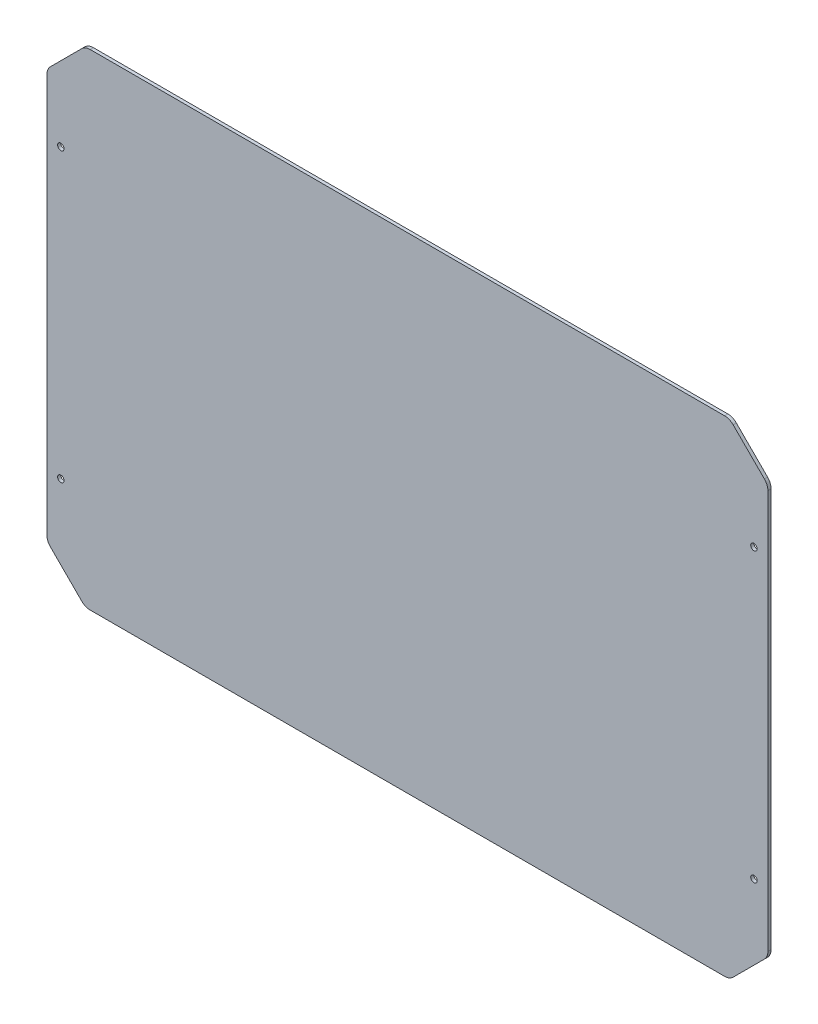
ISO-10303-21;
HEADER;
FILE_DESCRIPTION(('STEP AP214'),'2;1');
FILE_NAME('part.step','',(''),(''),'','','');
FILE_SCHEMA(('AUTOMOTIVE_DESIGN { 1 0 10303 214 1 1 1 1 }'));
ENDSEC;
DATA;
#1=APPLICATION_CONTEXT('core data for automotive mechanical design processes');
#2=APPLICATION_PROTOCOL_DEFINITION('international standard','automotive_design',2000,#1);
#3=PRODUCT_CONTEXT('',#1,'mechanical');
#4=PRODUCT('Part','Part','',(#3));
#5=PRODUCT_RELATED_PRODUCT_CATEGORY('part','',(#4));
#6=PRODUCT_DEFINITION_FORMATION('','',#4);
#7=PRODUCT_DEFINITION_CONTEXT('part definition',#1,'design');
#8=PRODUCT_DEFINITION('design','',#6,#7);
#9=PRODUCT_DEFINITION_SHAPE('','',#8);
#10=(LENGTH_UNIT() NAMED_UNIT(*) SI_UNIT(.MILLI.,.METRE.));
#11=(NAMED_UNIT(*) PLANE_ANGLE_UNIT() SI_UNIT($,.RADIAN.));
#12=(NAMED_UNIT(*) SI_UNIT($,.STERADIAN.) SOLID_ANGLE_UNIT());
#13=UNCERTAINTY_MEASURE_WITH_UNIT(LENGTH_MEASURE(1.E-05),#10,'distance_accuracy_value','');
#14=(GEOMETRIC_REPRESENTATION_CONTEXT(3) GLOBAL_UNCERTAINTY_ASSIGNED_CONTEXT((#13)) GLOBAL_UNIT_ASSIGNED_CONTEXT((#10,
#11,#12)) REPRESENTATION_CONTEXT('',''));
#15=CARTESIAN_POINT('',(0.,0.,0.));
#16=DIRECTION('',(0.,0.,1.));
#17=DIRECTION('',(1.,0.,0.));
#18=AXIS2_PLACEMENT_3D('',#15,#16,#17);
#19=CARTESIAN_POINT('',(0.,0.,4.));
#20=DIRECTION('',(0.,0.,1.));
#21=DIRECTION('',(1.,0.,0.));
#22=AXIS2_PLACEMENT_3D('',#19,#20,#21);
#23=PLANE('',#22);
#24=CARTESIAN_POINT('',(433.999999999995,-180.,4.));
#25=DIRECTION('',(0.,0.,1.));
#26=DIRECTION('',(1.,0.,0.));
#27=AXIS2_PLACEMENT_3D('',#24,#25,#26);
#28=CIRCLE('',#27,4.04999999999967);
#29=CARTESIAN_POINT('',(438.049999999995,-180.,4.));
#30=VERTEX_POINT('',#29);
#31=EDGE_CURVE('E295',#30,#30,#28,.T.);
#32=ORIENTED_EDGE('',*,*,#31,.F.);
#33=EDGE_LOOP('',(#32));
#34=FACE_BOUND('',#33,.T.);
#35=CARTESIAN_POINT('',(-433.999999999995,180.,4.));
#36=DIRECTION('',(0.,0.,1.));
#37=DIRECTION('',(1.,0.,0.));
#38=AXIS2_PLACEMENT_3D('',#35,#36,#37);
#39=CIRCLE('',#38,4.04999999999967);
#40=CARTESIAN_POINT('',(-429.949999999995,180.,4.));
#41=VERTEX_POINT('',#40);
#42=EDGE_CURVE('E174',#41,#41,#39,.T.);
#43=ORIENTED_EDGE('',*,*,#42,.F.);
#44=EDGE_LOOP('',(#43));
#45=FACE_BOUND('',#44,.T.);
#46=DIRECTION('',(0.,-1.,0.));
#47=VECTOR('',#46,1.);
#48=CARTESIAN_POINT('',(-451.499999999995,256.000000000005,4.));
#49=LINE('',#48,#47);
#50=CARTESIAN_POINT('',(-451.499999999995,249.786796564409,4.));
#51=VERTEX_POINT('',#50);
#52=CARTESIAN_POINT('',(-451.499999999995,-249.786796564402,4.));
#53=VERTEX_POINT('',#52);
#54=EDGE_CURVE('E183',#51,#53,#49,.T.);
#55=ORIENTED_EDGE('',*,*,#54,.T.);
#56=CARTESIAN_POINT('',(-436.499999999995,-249.786796564402,4.));
#57=DIRECTION('',(0.,0.,1.));
#58=DIRECTION('',(1.,0.,0.));
#59=AXIS2_PLACEMENT_3D('',#56,#57,#58);
#60=CIRCLE('',#59,15.);
#61=CARTESIAN_POINT('',(-447.106601717793,-260.393398282201,4.));
#62=VERTEX_POINT('',#61);
#63=EDGE_CURVE('E230',#53,#62,#60,.T.);
#64=ORIENTED_EDGE('',*,*,#63,.T.);
#65=DIRECTION('',(0.707106781186548,-0.707106781186547,0.));
#66=VECTOR('',#65,1.);
#67=CARTESIAN_POINT('',(-451.499999999995,-255.999999999999,4.));
#68=LINE('',#67,#66);
#69=CARTESIAN_POINT('',(-407.893398282196,-299.606601717798,4.));
#70=VERTEX_POINT('',#69);
#71=EDGE_CURVE('E166',#62,#70,#68,.T.);
#72=ORIENTED_EDGE('',*,*,#71,.T.);
#73=CARTESIAN_POINT('',(-397.286796564398,-289.,4.));
#74=DIRECTION('',(0.,0.,1.));
#75=DIRECTION('',(1.,0.,0.));
#76=AXIS2_PLACEMENT_3D('',#73,#74,#75);
#77=CIRCLE('',#76,15.);
#78=CARTESIAN_POINT('',(-397.286796564398,-304.,4.));
#79=VERTEX_POINT('',#78);
#80=EDGE_CURVE('E228',#70,#79,#77,.T.);
#81=ORIENTED_EDGE('',*,*,#80,.T.);
#82=DIRECTION('',(1.,0.,0.));
#83=VECTOR('',#82,1.);
#84=CARTESIAN_POINT('',(-403.499999999994,-304.,4.));
#85=LINE('',#84,#83);
#86=CARTESIAN_POINT('',(397.286796564398,-304.,4.));
#87=VERTEX_POINT('',#86);
#88=EDGE_CURVE('E285',#79,#87,#85,.T.);
#89=ORIENTED_EDGE('',*,*,#88,.T.);
#90=CARTESIAN_POINT('',(397.286796564398,-289.,4.));
#91=DIRECTION('',(0.,0.,1.));
#92=DIRECTION('',(1.,0.,0.));
#93=AXIS2_PLACEMENT_3D('',#90,#91,#92);
#94=CIRCLE('',#93,15.);
#95=CARTESIAN_POINT('',(407.893398282197,-299.606601717798,4.));
#96=VERTEX_POINT('',#95);
#97=EDGE_CURVE('E226',#87,#96,#94,.T.);
#98=ORIENTED_EDGE('',*,*,#97,.T.);
#99=DIRECTION('',(0.707106781186547,0.707106781186548,0.));
#100=VECTOR('',#99,1.);
#101=CARTESIAN_POINT('',(403.499999999995,-304.,4.));
#102=LINE('',#101,#100);
#103=CARTESIAN_POINT('',(447.106601717803,-260.393398282191,4.));
#104=VERTEX_POINT('',#103);
#105=EDGE_CURVE('E282',#96,#104,#102,.T.);
#106=ORIENTED_EDGE('',*,*,#105,.T.);
#107=CARTESIAN_POINT('',(436.500000000005,-249.786796564393,4.));
#108=DIRECTION('',(0.,0.,1.));
#109=DIRECTION('',(1.,0.,0.));
#110=AXIS2_PLACEMENT_3D('',#107,#108,#109);
#111=CIRCLE('',#110,15.);
#112=CARTESIAN_POINT('',(451.500000000005,-249.786796564393,4.));
#113=VERTEX_POINT('',#112);
#114=EDGE_CURVE('E224',#104,#113,#111,.T.);
#115=ORIENTED_EDGE('',*,*,#114,.T.);
#116=DIRECTION('',(0.,1.,0.));
#117=VECTOR('',#116,1.);
#118=CARTESIAN_POINT('',(451.500000000005,255.999999999995,4.));
#119=LINE('',#118,#117);
#120=CARTESIAN_POINT('',(451.500000000005,249.786796564399,4.));
#121=VERTEX_POINT('',#120);
#122=EDGE_CURVE('E279',#113,#121,#119,.T.);
#123=ORIENTED_EDGE('',*,*,#122,.T.);
#124=CARTESIAN_POINT('',(436.500000000005,249.786796564399,4.));
#125=DIRECTION('',(0.,0.,1.));
#126=DIRECTION('',(1.,0.,0.));
#127=AXIS2_PLACEMENT_3D('',#124,#125,#126);
#128=CIRCLE('',#127,15.);
#129=CARTESIAN_POINT('',(447.106601717803,260.393398282197,4.));
#130=VERTEX_POINT('',#129);
#131=EDGE_CURVE('E222',#121,#130,#128,.T.);
#132=ORIENTED_EDGE('',*,*,#131,.T.);
#133=DIRECTION('',(-0.707106781186548,0.707106781186548,0.));
#134=VECTOR('',#133,1.);
#135=CARTESIAN_POINT('',(403.5,304.,4.));
#136=LINE('',#135,#134);
#137=CARTESIAN_POINT('',(407.893398282202,299.606601717798,4.));
#138=VERTEX_POINT('',#137);
#139=EDGE_CURVE('E274',#130,#138,#136,.T.);
#140=ORIENTED_EDGE('',*,*,#139,.T.);
#141=CARTESIAN_POINT('',(397.286796564404,289.,4.));
#142=DIRECTION('',(0.,0.,1.));
#143=DIRECTION('',(1.,0.,0.));
#144=AXIS2_PLACEMENT_3D('',#141,#142,#143);
#145=CIRCLE('',#144,15.);
#146=CARTESIAN_POINT('',(397.286796564404,304.,4.));
#147=VERTEX_POINT('',#146);
#148=EDGE_CURVE('E220',#138,#147,#145,.T.);
#149=ORIENTED_EDGE('',*,*,#148,.T.);
#150=DIRECTION('',(-1.,0.,0.));
#151=VECTOR('',#150,1.);
#152=CARTESIAN_POINT('',(-403.500000000001,304.,4.));
#153=LINE('',#152,#151);
#154=CARTESIAN_POINT('',(-397.286796564404,304.,4.));
#155=VERTEX_POINT('',#154);
#156=EDGE_CURVE('E262',#147,#155,#153,.T.);
#157=ORIENTED_EDGE('',*,*,#156,.T.);
#158=CARTESIAN_POINT('',(-397.286796564404,289.,4.));
#159=DIRECTION('',(0.,0.,1.));
#160=DIRECTION('',(1.,0.,0.));
#161=AXIS2_PLACEMENT_3D('',#158,#159,#160);
#162=CIRCLE('',#161,15.);
#163=CARTESIAN_POINT('',(-407.893398282202,299.606601717798,4.));
#164=VERTEX_POINT('',#163);
#165=EDGE_CURVE('E53',#155,#164,#162,.T.);
#166=ORIENTED_EDGE('',*,*,#165,.T.);
#167=DIRECTION('',(-0.707106781186548,-0.707106781186547,0.));
#168=VECTOR('',#167,1.);
#169=CARTESIAN_POINT('',(-403.500000000001,304.,4.));
#170=LINE('',#169,#168);
#171=CARTESIAN_POINT('',(-447.106601717793,260.393398282207,4.));
#172=VERTEX_POINT('',#171);
#173=EDGE_CURVE('E271',#164,#172,#170,.T.);
#174=ORIENTED_EDGE('',*,*,#173,.T.);
#175=CARTESIAN_POINT('',(-436.499999999995,249.786796564409,4.));
#176=DIRECTION('',(0.,0.,1.));
#177=DIRECTION('',(1.,0.,0.));
#178=AXIS2_PLACEMENT_3D('',#175,#176,#177);
#179=CIRCLE('',#178,15.);
#180=EDGE_CURVE('E217',#172,#51,#179,.T.);
#181=ORIENTED_EDGE('',*,*,#180,.T.);
#182=EDGE_LOOP('',(#55,#64,#72,#81,#89,#98,#106,#115,#123,#132,#140,#149,#157,#166,#174,#181));
#183=FACE_BOUND('',#182,.T.);
#184=CARTESIAN_POINT('',(-433.999999999995,-180.,4.));
#185=DIRECTION('',(0.,0.,1.));
#186=DIRECTION('',(1.,0.,0.));
#187=AXIS2_PLACEMENT_3D('',#184,#185,#186);
#188=CIRCLE('',#187,4.04999999999967);
#189=CARTESIAN_POINT('',(-429.949999999995,-180.,4.));
#190=VERTEX_POINT('',#189);
#191=EDGE_CURVE('E290',#190,#190,#188,.T.);
#192=ORIENTED_EDGE('',*,*,#191,.F.);
#193=EDGE_LOOP('',(#192));
#194=FACE_BOUND('',#193,.T.);
#195=CARTESIAN_POINT('',(433.999999999995,180.,4.));
#196=DIRECTION('',(0.,0.,1.));
#197=DIRECTION('',(1.,0.,0.));
#198=AXIS2_PLACEMENT_3D('',#195,#196,#197);
#199=CIRCLE('',#198,4.04999999999967);
#200=CARTESIAN_POINT('',(438.049999999995,180.,4.));
#201=VERTEX_POINT('',#200);
#202=EDGE_CURVE('E301',#201,#201,#199,.T.);
#203=ORIENTED_EDGE('',*,*,#202,.F.);
#204=EDGE_LOOP('',(#203));
#205=FACE_BOUND('',#204,.T.);
#206=ADVANCED_FACE('F32',(#34,#45,#183,#194,#205),#23,.T.);
#207=CARTESIAN_POINT('',(0.,0.,0.));
#208=DIRECTION('',(0.,0.,1.));
#209=DIRECTION('',(1.,0.,0.));
#210=AXIS2_PLACEMENT_3D('',#207,#208,#209);
#211=PLANE('',#210);
#212=DIRECTION('',(0.707106781186548,-0.707106781186547,0.));
#213=VECTOR('',#212,1.);
#214=CARTESIAN_POINT('',(-451.499999999995,-255.999999999999,0.));
#215=LINE('',#214,#213);
#216=CARTESIAN_POINT('',(-447.106601717793,-260.393398282201,0.));
#217=VERTEX_POINT('',#216);
#218=CARTESIAN_POINT('',(-407.893398282196,-299.606601717798,0.));
#219=VERTEX_POINT('',#218);
#220=EDGE_CURVE('E163',#217,#219,#215,.T.);
#221=ORIENTED_EDGE('',*,*,#220,.F.);
#222=CARTESIAN_POINT('',(-436.499999999995,-249.786796564402,0.));
#223=DIRECTION('',(0.,0.,1.));
#224=DIRECTION('',(1.,0.,0.));
#225=AXIS2_PLACEMENT_3D('',#222,#223,#224);
#226=CIRCLE('',#225,15.);
#227=CARTESIAN_POINT('',(-451.499999999995,-249.786796564402,0.));
#228=VERTEX_POINT('',#227);
#229=EDGE_CURVE('E146',#217,#228,#226,.F.);
#230=ORIENTED_EDGE('',*,*,#229,.T.);
#231=DIRECTION('',(0.,-1.,0.));
#232=VECTOR('',#231,1.);
#233=CARTESIAN_POINT('',(-451.499999999995,256.000000000005,0.));
#234=LINE('',#233,#232);
#235=CARTESIAN_POINT('',(-451.499999999995,249.786796564409,0.));
#236=VERTEX_POINT('',#235);
#237=EDGE_CURVE('E199',#236,#228,#234,.T.);
#238=ORIENTED_EDGE('',*,*,#237,.F.);
#239=CARTESIAN_POINT('',(-436.499999999995,249.786796564409,0.));
#240=DIRECTION('',(0.,0.,1.));
#241=DIRECTION('',(1.,0.,0.));
#242=AXIS2_PLACEMENT_3D('',#239,#240,#241);
#243=CIRCLE('',#242,15.);
#244=CARTESIAN_POINT('',(-447.106601717793,260.393398282207,0.));
#245=VERTEX_POINT('',#244);
#246=EDGE_CURVE('E167',#236,#245,#243,.F.);
#247=ORIENTED_EDGE('',*,*,#246,.T.);
#248=DIRECTION('',(-0.707106781186548,-0.707106781186547,0.));
#249=VECTOR('',#248,1.);
#250=CARTESIAN_POINT('',(-403.500000000001,304.,0.));
#251=LINE('',#250,#249);
#252=CARTESIAN_POINT('',(-407.893398282202,299.606601717798,0.));
#253=VERTEX_POINT('',#252);
#254=EDGE_CURVE('E197',#253,#245,#251,.T.);
#255=ORIENTED_EDGE('',*,*,#254,.F.);
#256=CARTESIAN_POINT('',(-397.286796564404,289.,0.));
#257=DIRECTION('',(0.,0.,1.));
#258=DIRECTION('',(1.,0.,0.));
#259=AXIS2_PLACEMENT_3D('',#256,#257,#258);
#260=CIRCLE('',#259,15.);
#261=CARTESIAN_POINT('',(-397.286796564404,304.,0.));
#262=VERTEX_POINT('',#261);
#263=EDGE_CURVE('E203',#253,#262,#260,.F.);
#264=ORIENTED_EDGE('',*,*,#263,.T.);
#265=DIRECTION('',(-1.,0.,0.));
#266=VECTOR('',#265,1.);
#267=CARTESIAN_POINT('',(-403.500000000001,304.,0.));
#268=LINE('',#267,#266);
#269=CARTESIAN_POINT('',(397.286796564404,304.,0.));
#270=VERTEX_POINT('',#269);
#271=EDGE_CURVE('E194',#270,#262,#268,.T.);
#272=ORIENTED_EDGE('',*,*,#271,.F.);
#273=CARTESIAN_POINT('',(397.286796564404,289.,0.));
#274=DIRECTION('',(0.,0.,1.));
#275=DIRECTION('',(1.,0.,0.));
#276=AXIS2_PLACEMENT_3D('',#273,#274,#275);
#277=CIRCLE('',#276,15.);
#278=CARTESIAN_POINT('',(407.893398282202,299.606601717798,0.));
#279=VERTEX_POINT('',#278);
#280=EDGE_CURVE('E205',#270,#279,#277,.F.);
#281=ORIENTED_EDGE('',*,*,#280,.T.);
#282=DIRECTION('',(-0.707106781186548,0.707106781186548,0.));
#283=VECTOR('',#282,1.);
#284=CARTESIAN_POINT('',(403.5,304.,0.));
#285=LINE('',#284,#283);
#286=CARTESIAN_POINT('',(447.106601717803,260.393398282197,0.));
#287=VERTEX_POINT('',#286);
#288=EDGE_CURVE('E191',#287,#279,#285,.T.);
#289=ORIENTED_EDGE('',*,*,#288,.F.);
#290=CARTESIAN_POINT('',(436.500000000005,249.786796564399,0.));
#291=DIRECTION('',(0.,0.,1.));
#292=DIRECTION('',(1.,0.,0.));
#293=AXIS2_PLACEMENT_3D('',#290,#291,#292);
#294=CIRCLE('',#293,15.);
#295=CARTESIAN_POINT('',(451.500000000005,249.786796564399,0.));
#296=VERTEX_POINT('',#295);
#297=EDGE_CURVE('E207',#287,#296,#294,.F.);
#298=ORIENTED_EDGE('',*,*,#297,.T.);
#299=DIRECTION('',(0.,1.,0.));
#300=VECTOR('',#299,1.);
#301=CARTESIAN_POINT('',(451.500000000005,255.999999999995,0.));
#302=LINE('',#301,#300);
#303=CARTESIAN_POINT('',(451.500000000005,-249.786796564393,0.));
#304=VERTEX_POINT('',#303);
#305=EDGE_CURVE('E188',#304,#296,#302,.T.);
#306=ORIENTED_EDGE('',*,*,#305,.F.);
#307=CARTESIAN_POINT('',(436.500000000005,-249.786796564393,0.));
#308=DIRECTION('',(0.,0.,1.));
#309=DIRECTION('',(1.,0.,0.));
#310=AXIS2_PLACEMENT_3D('',#307,#308,#309);
#311=CIRCLE('',#310,15.);
#312=CARTESIAN_POINT('',(447.106601717803,-260.393398282191,0.));
#313=VERTEX_POINT('',#312);
#314=EDGE_CURVE('E209',#304,#313,#311,.F.);
#315=ORIENTED_EDGE('',*,*,#314,.T.);
#316=DIRECTION('',(0.707106781186547,0.707106781186548,0.));
#317=VECTOR('',#316,1.);
#318=CARTESIAN_POINT('',(403.499999999995,-304.,0.));
#319=LINE('',#318,#317);
#320=CARTESIAN_POINT('',(407.893398282197,-299.606601717798,0.));
#321=VERTEX_POINT('',#320);
#322=EDGE_CURVE('E177',#321,#313,#319,.T.);
#323=ORIENTED_EDGE('',*,*,#322,.F.);
#324=CARTESIAN_POINT('',(397.286796564398,-289.,0.));
#325=DIRECTION('',(0.,0.,1.));
#326=DIRECTION('',(1.,0.,0.));
#327=AXIS2_PLACEMENT_3D('',#324,#325,#326);
#328=CIRCLE('',#327,15.);
#329=CARTESIAN_POINT('',(397.286796564398,-304.,0.));
#330=VERTEX_POINT('',#329);
#331=EDGE_CURVE('E211',#321,#330,#328,.F.);
#332=ORIENTED_EDGE('',*,*,#331,.T.);
#333=DIRECTION('',(1.,0.,0.));
#334=VECTOR('',#333,1.);
#335=CARTESIAN_POINT('',(-403.499999999994,-304.,0.));
#336=LINE('',#335,#334);
#337=CARTESIAN_POINT('',(-397.286796564398,-304.,0.));
#338=VERTEX_POINT('',#337);
#339=EDGE_CURVE('E173',#338,#330,#336,.T.);
#340=ORIENTED_EDGE('',*,*,#339,.F.);
#341=CARTESIAN_POINT('',(-397.286796564398,-289.,0.));
#342=DIRECTION('',(0.,0.,1.));
#343=DIRECTION('',(1.,0.,0.));
#344=AXIS2_PLACEMENT_3D('',#341,#342,#343);
#345=CIRCLE('',#344,15.);
#346=EDGE_CURVE('E157',#338,#219,#345,.F.);
#347=ORIENTED_EDGE('',*,*,#346,.T.);
#348=EDGE_LOOP('',(#221,#230,#238,#247,#255,#264,#272,#281,#289,#298,#306,#315,#323,#332,#340,#347));
#349=FACE_BOUND('',#348,.T.);
#350=CARTESIAN_POINT('',(-433.999999999995,180.,0.));
#351=DIRECTION('',(0.,0.,1.));
#352=DIRECTION('',(1.,0.,0.));
#353=AXIS2_PLACEMENT_3D('',#350,#351,#352);
#354=CIRCLE('',#353,4.04999999999967);
#355=CARTESIAN_POINT('',(-429.949999999995,180.,0.));
#356=VERTEX_POINT('',#355);
#357=EDGE_CURVE('E180',#356,#356,#354,.T.);
#358=ORIENTED_EDGE('',*,*,#357,.T.);
#359=EDGE_LOOP('',(#358));
#360=FACE_BOUND('',#359,.T.);
#361=CARTESIAN_POINT('',(-433.999999999995,-180.,0.));
#362=DIRECTION('',(0.,0.,1.));
#363=DIRECTION('',(1.,0.,0.));
#364=AXIS2_PLACEMENT_3D('',#361,#362,#363);
#365=CIRCLE('',#364,4.04999999999967);
#366=CARTESIAN_POINT('',(-429.949999999995,-180.,0.));
#367=VERTEX_POINT('',#366);
#368=EDGE_CURVE('E292',#367,#367,#365,.T.);
#369=ORIENTED_EDGE('',*,*,#368,.T.);
#370=EDGE_LOOP('',(#369));
#371=FACE_BOUND('',#370,.T.);
#372=CARTESIAN_POINT('',(433.999999999995,-180.,0.));
#373=DIRECTION('',(0.,0.,1.));
#374=DIRECTION('',(1.,0.,0.));
#375=AXIS2_PLACEMENT_3D('',#372,#373,#374);
#376=CIRCLE('',#375,4.04999999999967);
#377=CARTESIAN_POINT('',(438.049999999995,-180.,0.));
#378=VERTEX_POINT('',#377);
#379=EDGE_CURVE('E298',#378,#378,#376,.T.);
#380=ORIENTED_EDGE('',*,*,#379,.T.);
#381=EDGE_LOOP('',(#380));
#382=FACE_BOUND('',#381,.T.);
#383=CARTESIAN_POINT('',(433.999999999995,180.,0.));
#384=DIRECTION('',(0.,0.,1.));
#385=DIRECTION('',(1.,0.,0.));
#386=AXIS2_PLACEMENT_3D('',#383,#384,#385);
#387=CIRCLE('',#386,4.04999999999967);
#388=CARTESIAN_POINT('',(438.049999999995,180.,0.));
#389=VERTEX_POINT('',#388);
#390=EDGE_CURVE('E304',#389,#389,#387,.T.);
#391=ORIENTED_EDGE('',*,*,#390,.T.);
#392=EDGE_LOOP('',(#391));
#393=FACE_BOUND('',#392,.T.);
#394=ADVANCED_FACE('F170',(#349,#360,#371,#382,#393),#211,.F.);
#395=CARTESIAN_POINT('',(-451.499999999995,-255.999999999999,4.));
#396=DIRECTION('',(0.707106781186547,0.707106781186548,0.));
#397=DIRECTION('',(-0.707106781186548,0.707106781186547,0.));
#398=AXIS2_PLACEMENT_3D('',#395,#396,#397);
#399=PLANE('',#398);
#400=ORIENTED_EDGE('',*,*,#71,.F.);
#401=DIRECTION('',(0.,0.,-1.));
#402=VECTOR('',#401,1.);
#403=CARTESIAN_POINT('',(-447.106601717793,-260.393398282201,4.));
#404=LINE('',#403,#402);
#405=EDGE_CURVE('E150',#62,#217,#404,.T.);
#406=ORIENTED_EDGE('',*,*,#405,.T.);
#407=ORIENTED_EDGE('',*,*,#220,.T.);
#408=DIRECTION('',(0.,0.,-1.));
#409=VECTOR('',#408,1.);
#410=CARTESIAN_POINT('',(-407.893398282196,-299.606601717798,4.));
#411=LINE('',#410,#409);
#412=EDGE_CURVE('E168',#219,#70,#411,.F.);
#413=ORIENTED_EDGE('',*,*,#412,.T.);
#414=EDGE_LOOP('',(#400,#406,#407,#413));
#415=FACE_BOUND('',#414,.T.);
#416=ADVANCED_FACE('F162',(#415),#399,.F.);
#417=CARTESIAN_POINT('',(-403.499999999994,-304.,4.));
#418=DIRECTION('',(0.,1.,0.));
#419=DIRECTION('',(-1.,0.,0.));
#420=AXIS2_PLACEMENT_3D('',#417,#418,#419);
#421=PLANE('',#420);
#422=ORIENTED_EDGE('',*,*,#88,.F.);
#423=DIRECTION('',(0.,0.,-1.));
#424=VECTOR('',#423,1.);
#425=CARTESIAN_POINT('',(-397.286796564398,-304.,4.));
#426=LINE('',#425,#424);
#427=EDGE_CURVE('E234',#79,#338,#426,.T.);
#428=ORIENTED_EDGE('',*,*,#427,.T.);
#429=ORIENTED_EDGE('',*,*,#339,.T.);
#430=DIRECTION('',(0.,0.,-1.));
#431=VECTOR('',#430,1.);
#432=CARTESIAN_POINT('',(397.286796564398,-304.,4.));
#433=LINE('',#432,#431);
#434=EDGE_CURVE('E232',#330,#87,#433,.F.);
#435=ORIENTED_EDGE('',*,*,#434,.T.);
#436=EDGE_LOOP('',(#422,#428,#429,#435));
#437=FACE_BOUND('',#436,.T.);
#438=ADVANCED_FACE('F345',(#437),#421,.F.);
#439=CARTESIAN_POINT('',(403.499999999995,-304.,4.));
#440=DIRECTION('',(-0.707106781186548,0.707106781186547,0.));
#441=DIRECTION('',(-0.707106781186547,-0.707106781186548,0.));
#442=AXIS2_PLACEMENT_3D('',#439,#440,#441);
#443=PLANE('',#442);
#444=ORIENTED_EDGE('',*,*,#105,.F.);
#445=DIRECTION('',(0.,0.,-1.));
#446=VECTOR('',#445,1.);
#447=CARTESIAN_POINT('',(407.893398282197,-299.606601717798,4.));
#448=LINE('',#447,#446);
#449=EDGE_CURVE('E239',#96,#321,#448,.T.);
#450=ORIENTED_EDGE('',*,*,#449,.T.);
#451=ORIENTED_EDGE('',*,*,#322,.T.);
#452=DIRECTION('',(0.,0.,-1.));
#453=VECTOR('',#452,1.);
#454=CARTESIAN_POINT('',(447.106601717803,-260.393398282191,4.));
#455=LINE('',#454,#453);
#456=EDGE_CURVE('E237',#313,#104,#455,.F.);
#457=ORIENTED_EDGE('',*,*,#456,.T.);
#458=EDGE_LOOP('',(#444,#450,#451,#457));
#459=FACE_BOUND('',#458,.T.);
#460=ADVANCED_FACE('F341',(#459),#443,.F.);
#461=CARTESIAN_POINT('',(451.500000000005,255.999999999995,4.));
#462=DIRECTION('',(-1.,0.,0.));
#463=DIRECTION('',(0.,0.,1.));
#464=AXIS2_PLACEMENT_3D('',#461,#462,#463);
#465=PLANE('',#464);
#466=ORIENTED_EDGE('',*,*,#122,.F.);
#467=DIRECTION('',(0.,0.,-1.));
#468=VECTOR('',#467,1.);
#469=CARTESIAN_POINT('',(451.500000000005,-249.786796564393,4.));
#470=LINE('',#469,#468);
#471=EDGE_CURVE('E244',#113,#304,#470,.T.);
#472=ORIENTED_EDGE('',*,*,#471,.T.);
#473=ORIENTED_EDGE('',*,*,#305,.T.);
#474=DIRECTION('',(0.,0.,-1.));
#475=VECTOR('',#474,1.);
#476=CARTESIAN_POINT('',(451.500000000005,249.786796564399,4.));
#477=LINE('',#476,#475);
#478=EDGE_CURVE('E242',#296,#121,#477,.F.);
#479=ORIENTED_EDGE('',*,*,#478,.T.);
#480=EDGE_LOOP('',(#466,#472,#473,#479));
#481=FACE_BOUND('',#480,.T.);
#482=ADVANCED_FACE('F337',(#481),#465,.F.);
#483=CARTESIAN_POINT('',(403.5,304.,4.));
#484=DIRECTION('',(-0.707106781186547,-0.707106781186547,0.));
#485=DIRECTION('',(0.707106781186548,-0.707106781186548,0.));
#486=AXIS2_PLACEMENT_3D('',#483,#484,#485);
#487=PLANE('',#486);
#488=ORIENTED_EDGE('',*,*,#139,.F.);
#489=DIRECTION('',(0.,0.,-1.));
#490=VECTOR('',#489,1.);
#491=CARTESIAN_POINT('',(447.106601717803,260.393398282197,4.));
#492=LINE('',#491,#490);
#493=EDGE_CURVE('E249',#130,#287,#492,.T.);
#494=ORIENTED_EDGE('',*,*,#493,.T.);
#495=ORIENTED_EDGE('',*,*,#288,.T.);
#496=DIRECTION('',(0.,0.,-1.));
#497=VECTOR('',#496,1.);
#498=CARTESIAN_POINT('',(407.893398282202,299.606601717798,4.));
#499=LINE('',#498,#497);
#500=EDGE_CURVE('E247',#279,#138,#499,.F.);
#501=ORIENTED_EDGE('',*,*,#500,.T.);
#502=EDGE_LOOP('',(#488,#494,#495,#501));
#503=FACE_BOUND('',#502,.T.);
#504=ADVANCED_FACE('F334',(#503),#487,.F.);
#505=CARTESIAN_POINT('',(-403.500000000001,304.,4.));
#506=DIRECTION('',(0.,-1.,0.));
#507=DIRECTION('',(1.,0.,0.));
#508=AXIS2_PLACEMENT_3D('',#505,#506,#507);
#509=PLANE('',#508);
#510=ORIENTED_EDGE('',*,*,#156,.F.);
#511=DIRECTION('',(0.,0.,-1.));
#512=VECTOR('',#511,1.);
#513=CARTESIAN_POINT('',(397.286796564404,304.,4.));
#514=LINE('',#513,#512);
#515=EDGE_CURVE('E254',#147,#270,#514,.T.);
#516=ORIENTED_EDGE('',*,*,#515,.T.);
#517=ORIENTED_EDGE('',*,*,#271,.T.);
#518=DIRECTION('',(0.,0.,-1.));
#519=VECTOR('',#518,1.);
#520=CARTESIAN_POINT('',(-397.286796564404,304.,4.));
#521=LINE('',#520,#519);
#522=EDGE_CURVE('E252',#262,#155,#521,.F.);
#523=ORIENTED_EDGE('',*,*,#522,.T.);
#524=EDGE_LOOP('',(#510,#516,#517,#523));
#525=FACE_BOUND('',#524,.T.);
#526=ADVANCED_FACE('F260',(#525),#509,.F.);
#527=CARTESIAN_POINT('',(-403.500000000001,304.,4.));
#528=DIRECTION('',(0.707106781186547,-0.707106781186548,0.));
#529=DIRECTION('',(0.707106781186548,0.707106781186547,0.));
#530=AXIS2_PLACEMENT_3D('',#527,#528,#529);
#531=PLANE('',#530);
#532=ORIENTED_EDGE('',*,*,#173,.F.);
#533=DIRECTION('',(0.,0.,-1.));
#534=VECTOR('',#533,1.);
#535=CARTESIAN_POINT('',(-407.893398282202,299.606601717798,4.));
#536=LINE('',#535,#534);
#537=EDGE_CURVE('E11',#164,#253,#536,.T.);
#538=ORIENTED_EDGE('',*,*,#537,.T.);
#539=ORIENTED_EDGE('',*,*,#254,.T.);
#540=DIRECTION('',(0.,0.,-1.));
#541=VECTOR('',#540,1.);
#542=CARTESIAN_POINT('',(-447.106601717793,260.393398282207,4.));
#543=LINE('',#542,#541);
#544=EDGE_CURVE('E40',#245,#172,#543,.F.);
#545=ORIENTED_EDGE('',*,*,#544,.T.);
#546=EDGE_LOOP('',(#532,#538,#539,#545));
#547=FACE_BOUND('',#546,.T.);
#548=ADVANCED_FACE('F270',(#547),#531,.F.);
#549=CARTESIAN_POINT('',(-451.499999999995,256.000000000005,4.));
#550=DIRECTION('',(1.,0.,0.));
#551=DIRECTION('',(0.,0.,-1.));
#552=AXIS2_PLACEMENT_3D('',#549,#550,#551);
#553=PLANE('',#552);
#554=ORIENTED_EDGE('',*,*,#237,.T.);
#555=DIRECTION('',(0.,0.,-1.));
#556=VECTOR('',#555,1.);
#557=CARTESIAN_POINT('',(-451.499999999995,-249.786796564402,4.));
#558=LINE('',#557,#556);
#559=EDGE_CURVE('E151',#228,#53,#558,.F.);
#560=ORIENTED_EDGE('',*,*,#559,.T.);
#561=ORIENTED_EDGE('',*,*,#54,.F.);
#562=DIRECTION('',(0.,0.,-1.));
#563=VECTOR('',#562,1.);
#564=CARTESIAN_POINT('',(-451.499999999995,249.786796564409,4.));
#565=LINE('',#564,#563);
#566=EDGE_CURVE('E156',#51,#236,#565,.T.);
#567=ORIENTED_EDGE('',*,*,#566,.T.);
#568=EDGE_LOOP('',(#554,#560,#561,#567));
#569=FACE_BOUND('',#568,.T.);
#570=ADVANCED_FACE('F326',(#569),#553,.F.);
#571=CARTESIAN_POINT('',(-433.999999999995,180.,4.));
#572=DIRECTION('',(0.,0.,-1.));
#573=DIRECTION('',(-1.,0.,0.));
#574=AXIS2_PLACEMENT_3D('',#571,#572,#573);
#575=CYLINDRICAL_SURFACE('',#574,4.04999999999967);
#576=ORIENTED_EDGE('',*,*,#42,.T.);
#577=EDGE_LOOP('',(#576));
#578=FACE_BOUND('',#577,.T.);
#579=ORIENTED_EDGE('',*,*,#357,.F.);
#580=EDGE_LOOP('',(#579));
#581=FACE_BOUND('',#580,.T.);
#582=ADVANCED_FACE('F323',(#578,#581),#575,.F.);
#583=CARTESIAN_POINT('',(-433.999999999995,-180.,4.));
#584=DIRECTION('',(0.,0.,-1.));
#585=DIRECTION('',(-1.,0.,0.));
#586=AXIS2_PLACEMENT_3D('',#583,#584,#585);
#587=CYLINDRICAL_SURFACE('',#586,4.04999999999967);
#588=ORIENTED_EDGE('',*,*,#191,.T.);
#589=EDGE_LOOP('',(#588));
#590=FACE_BOUND('',#589,.T.);
#591=ORIENTED_EDGE('',*,*,#368,.F.);
#592=EDGE_LOOP('',(#591));
#593=FACE_BOUND('',#592,.T.);
#594=ADVANCED_FACE('F402',(#590,#593),#587,.F.);
#595=CARTESIAN_POINT('',(433.999999999995,-180.,4.));
#596=DIRECTION('',(0.,0.,-1.));
#597=DIRECTION('',(-1.,0.,0.));
#598=AXIS2_PLACEMENT_3D('',#595,#596,#597);
#599=CYLINDRICAL_SURFACE('',#598,4.04999999999967);
#600=ORIENTED_EDGE('',*,*,#31,.T.);
#601=EDGE_LOOP('',(#600));
#602=FACE_BOUND('',#601,.T.);
#603=ORIENTED_EDGE('',*,*,#379,.F.);
#604=EDGE_LOOP('',(#603));
#605=FACE_BOUND('',#604,.T.);
#606=ADVANCED_FACE('F405',(#602,#605),#599,.F.);
#607=CARTESIAN_POINT('',(433.999999999995,180.,4.));
#608=DIRECTION('',(0.,0.,-1.));
#609=DIRECTION('',(-1.,0.,0.));
#610=AXIS2_PLACEMENT_3D('',#607,#608,#609);
#611=CYLINDRICAL_SURFACE('',#610,4.04999999999967);
#612=ORIENTED_EDGE('',*,*,#202,.T.);
#613=EDGE_LOOP('',(#612));
#614=FACE_BOUND('',#613,.T.);
#615=ORIENTED_EDGE('',*,*,#390,.F.);
#616=EDGE_LOOP('',(#615));
#617=FACE_BOUND('',#616,.T.);
#618=ADVANCED_FACE('F310',(#614,#617),#611,.F.);
#619=CARTESIAN_POINT('',(-436.499999999995,-249.786796564402,4.));
#620=DIRECTION('',(0.,0.,-1.));
#621=DIRECTION('',(-1.,0.,0.));
#622=AXIS2_PLACEMENT_3D('',#619,#620,#621);
#623=CYLINDRICAL_SURFACE('',#622,15.);
#624=ORIENTED_EDGE('',*,*,#63,.F.);
#625=ORIENTED_EDGE('',*,*,#559,.F.);
#626=ORIENTED_EDGE('',*,*,#229,.F.);
#627=ORIENTED_EDGE('',*,*,#405,.F.);
#628=EDGE_LOOP('',(#624,#625,#626,#627));
#629=FACE_BOUND('',#628,.T.);
#630=ADVANCED_FACE('F149',(#629),#623,.T.);
#631=CARTESIAN_POINT('',(-397.286796564398,-289.,4.));
#632=DIRECTION('',(0.,0.,-1.));
#633=DIRECTION('',(-1.,0.,0.));
#634=AXIS2_PLACEMENT_3D('',#631,#632,#633);
#635=CYLINDRICAL_SURFACE('',#634,15.);
#636=ORIENTED_EDGE('',*,*,#80,.F.);
#637=ORIENTED_EDGE('',*,*,#412,.F.);
#638=ORIENTED_EDGE('',*,*,#346,.F.);
#639=ORIENTED_EDGE('',*,*,#427,.F.);
#640=EDGE_LOOP('',(#636,#637,#638,#639));
#641=FACE_BOUND('',#640,.T.);
#642=ADVANCED_FACE('F354',(#641),#635,.T.);
#643=CARTESIAN_POINT('',(397.286796564398,-289.,4.));
#644=DIRECTION('',(0.,0.,-1.));
#645=DIRECTION('',(-1.,0.,0.));
#646=AXIS2_PLACEMENT_3D('',#643,#644,#645);
#647=CYLINDRICAL_SURFACE('',#646,15.);
#648=ORIENTED_EDGE('',*,*,#97,.F.);
#649=ORIENTED_EDGE('',*,*,#434,.F.);
#650=ORIENTED_EDGE('',*,*,#331,.F.);
#651=ORIENTED_EDGE('',*,*,#449,.F.);
#652=EDGE_LOOP('',(#648,#649,#650,#651));
#653=FACE_BOUND('',#652,.T.);
#654=ADVANCED_FACE('F357',(#653),#647,.T.);
#655=CARTESIAN_POINT('',(436.500000000005,-249.786796564393,4.));
#656=DIRECTION('',(0.,0.,-1.));
#657=DIRECTION('',(-1.,0.,0.));
#658=AXIS2_PLACEMENT_3D('',#655,#656,#657);
#659=CYLINDRICAL_SURFACE('',#658,15.);
#660=ORIENTED_EDGE('',*,*,#114,.F.);
#661=ORIENTED_EDGE('',*,*,#456,.F.);
#662=ORIENTED_EDGE('',*,*,#314,.F.);
#663=ORIENTED_EDGE('',*,*,#471,.F.);
#664=EDGE_LOOP('',(#660,#661,#662,#663));
#665=FACE_BOUND('',#664,.T.);
#666=ADVANCED_FACE('F361',(#665),#659,.T.);
#667=CARTESIAN_POINT('',(436.500000000005,249.786796564399,4.));
#668=DIRECTION('',(0.,0.,-1.));
#669=DIRECTION('',(-1.,0.,0.));
#670=AXIS2_PLACEMENT_3D('',#667,#668,#669);
#671=CYLINDRICAL_SURFACE('',#670,15.);
#672=ORIENTED_EDGE('',*,*,#131,.F.);
#673=ORIENTED_EDGE('',*,*,#478,.F.);
#674=ORIENTED_EDGE('',*,*,#297,.F.);
#675=ORIENTED_EDGE('',*,*,#493,.F.);
#676=EDGE_LOOP('',(#672,#673,#674,#675));
#677=FACE_BOUND('',#676,.T.);
#678=ADVANCED_FACE('F365',(#677),#671,.T.);
#679=CARTESIAN_POINT('',(397.286796564404,289.,4.));
#680=DIRECTION('',(0.,0.,-1.));
#681=DIRECTION('',(-1.,0.,0.));
#682=AXIS2_PLACEMENT_3D('',#679,#680,#681);
#683=CYLINDRICAL_SURFACE('',#682,15.);
#684=ORIENTED_EDGE('',*,*,#148,.F.);
#685=ORIENTED_EDGE('',*,*,#500,.F.);
#686=ORIENTED_EDGE('',*,*,#280,.F.);
#687=ORIENTED_EDGE('',*,*,#515,.F.);
#688=EDGE_LOOP('',(#684,#685,#686,#687));
#689=FACE_BOUND('',#688,.T.);
#690=ADVANCED_FACE('F369',(#689),#683,.T.);
#691=CARTESIAN_POINT('',(-397.286796564404,289.,4.));
#692=DIRECTION('',(0.,0.,-1.));
#693=DIRECTION('',(-1.,0.,0.));
#694=AXIS2_PLACEMENT_3D('',#691,#692,#693);
#695=CYLINDRICAL_SURFACE('',#694,15.);
#696=ORIENTED_EDGE('',*,*,#165,.F.);
#697=ORIENTED_EDGE('',*,*,#522,.F.);
#698=ORIENTED_EDGE('',*,*,#263,.F.);
#699=ORIENTED_EDGE('',*,*,#537,.F.);
#700=EDGE_LOOP('',(#696,#697,#698,#699));
#701=FACE_BOUND('',#700,.T.);
#702=ADVANCED_FACE('F269',(#701),#695,.T.);
#703=CARTESIAN_POINT('',(-436.499999999995,249.786796564409,4.));
#704=DIRECTION('',(0.,0.,-1.));
#705=DIRECTION('',(-1.,0.,0.));
#706=AXIS2_PLACEMENT_3D('',#703,#704,#705);
#707=CYLINDRICAL_SURFACE('',#706,15.);
#708=ORIENTED_EDGE('',*,*,#180,.F.);
#709=ORIENTED_EDGE('',*,*,#544,.F.);
#710=ORIENTED_EDGE('',*,*,#246,.F.);
#711=ORIENTED_EDGE('',*,*,#566,.F.);
#712=EDGE_LOOP('',(#708,#709,#710,#711));
#713=FACE_BOUND('',#712,.T.);
#714=ADVANCED_FACE('F34',(#713),#707,.T.);
#715=CLOSED_SHELL('',(#206,#394,#416,#438,#460,#482,#504,#526,#548,#570,#582,#594,#606,#618,
#630,#642,#654,#666,#678,#690,#702,#714));
#716=MANIFOLD_SOLID_BREP('B2',#715);
#717=ADVANCED_BREP_SHAPE_REPRESENTATION('',(#18,#716),#14);
#718=SHAPE_DEFINITION_REPRESENTATION(#9,#717);
ENDSEC;
END-ISO-10303-21;
